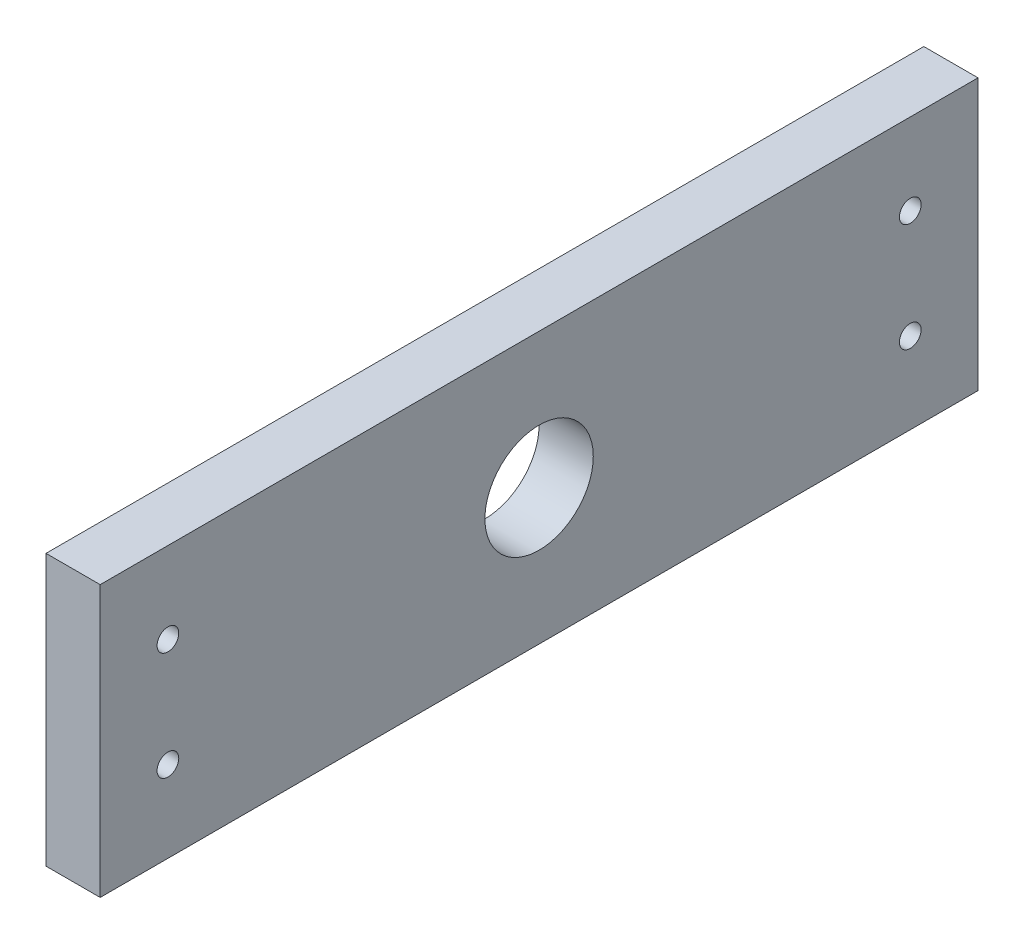
ISO-10303-21;
HEADER;
FILE_DESCRIPTION(('STEP AP214'),'2;1');
FILE_NAME('part.step','',(''),(''),'','','');
FILE_SCHEMA(('AUTOMOTIVE_DESIGN { 1 0 10303 214 1 1 1 1 }'));
ENDSEC;
DATA;
#1=APPLICATION_CONTEXT('core data for automotive mechanical design processes');
#2=APPLICATION_PROTOCOL_DEFINITION('international standard','automotive_design',2000,#1);
#3=PRODUCT_CONTEXT('',#1,'mechanical');
#4=PRODUCT('Part','Part','',(#3));
#5=PRODUCT_RELATED_PRODUCT_CATEGORY('part','',(#4));
#6=PRODUCT_DEFINITION_FORMATION('','',#4);
#7=PRODUCT_DEFINITION_CONTEXT('part definition',#1,'design');
#8=PRODUCT_DEFINITION('design','',#6,#7);
#9=PRODUCT_DEFINITION_SHAPE('','',#8);
#10=(LENGTH_UNIT() NAMED_UNIT(*) SI_UNIT(.MILLI.,.METRE.));
#11=(NAMED_UNIT(*) PLANE_ANGLE_UNIT() SI_UNIT($,.RADIAN.));
#12=(NAMED_UNIT(*) SI_UNIT($,.STERADIAN.) SOLID_ANGLE_UNIT());
#13=UNCERTAINTY_MEASURE_WITH_UNIT(LENGTH_MEASURE(1.E-05),#10,'distance_accuracy_value','');
#14=(GEOMETRIC_REPRESENTATION_CONTEXT(3) GLOBAL_UNCERTAINTY_ASSIGNED_CONTEXT((#13)) GLOBAL_UNIT_ASSIGNED_CONTEXT((#10,
#11,#12)) REPRESENTATION_CONTEXT('',''));
#15=CARTESIAN_POINT('',(0.,0.,0.));
#16=DIRECTION('',(0.,0.,1.));
#17=DIRECTION('',(1.,0.,0.));
#18=AXIS2_PLACEMENT_3D('',#15,#16,#17);
#19=CARTESIAN_POINT('',(10.,-25.,0.));
#20=DIRECTION('',(0.,1.,0.));
#21=DIRECTION('',(0.,0.,1.));
#22=AXIS2_PLACEMENT_3D('',#19,#20,#21);
#23=PLANE('',#22);
#24=DIRECTION('',(0.,0.,-1.));
#25=VECTOR('',#24,1.);
#26=CARTESIAN_POINT('',(0.,-25.,0.));
#27=LINE('',#26,#25);
#28=CARTESIAN_POINT('',(0.,-25.,81.));
#29=VERTEX_POINT('',#28);
#30=CARTESIAN_POINT('',(0.,-25.,-81.));
#31=VERTEX_POINT('',#30);
#32=EDGE_CURVE('E130',#29,#31,#27,.T.);
#33=ORIENTED_EDGE('',*,*,#32,.T.);
#34=DIRECTION('',(-1.,0.,0.));
#35=VECTOR('',#34,1.);
#36=CARTESIAN_POINT('',(10.,-25.,-81.));
#37=LINE('',#36,#35);
#38=CARTESIAN_POINT('',(10.,-25.,-81.));
#39=VERTEX_POINT('',#38);
#40=EDGE_CURVE('E11',#39,#31,#37,.T.);
#41=ORIENTED_EDGE('',*,*,#40,.F.);
#42=DIRECTION('',(0.,0.,-1.));
#43=VECTOR('',#42,1.);
#44=CARTESIAN_POINT('',(10.,-25.,0.));
#45=LINE('',#44,#43);
#46=CARTESIAN_POINT('',(10.,-25.,81.));
#47=VERTEX_POINT('',#46);
#48=EDGE_CURVE('E92',#47,#39,#45,.T.);
#49=ORIENTED_EDGE('',*,*,#48,.F.);
#50=DIRECTION('',(-1.,0.,0.));
#51=VECTOR('',#50,1.);
#52=CARTESIAN_POINT('',(10.,-25.,81.));
#53=LINE('',#52,#51);
#54=EDGE_CURVE('E58',#47,#29,#53,.T.);
#55=ORIENTED_EDGE('',*,*,#54,.T.);
#56=EDGE_LOOP('',(#33,#41,#49,#55));
#57=FACE_BOUND('',#56,.T.);
#58=ADVANCED_FACE('F41',(#57),#23,.F.);
#59=CARTESIAN_POINT('',(10.,0.,-81.));
#60=DIRECTION('',(0.,0.,1.));
#61=DIRECTION('',(1.,0.,0.));
#62=AXIS2_PLACEMENT_3D('',#59,#60,#61);
#63=PLANE('',#62);
#64=DIRECTION('',(0.,1.,0.));
#65=VECTOR('',#64,1.);
#66=CARTESIAN_POINT('',(0.,0.,-81.));
#67=LINE('',#66,#65);
#68=CARTESIAN_POINT('',(0.,25.,-81.));
#69=VERTEX_POINT('',#68);
#70=EDGE_CURVE('E98',#31,#69,#67,.T.);
#71=ORIENTED_EDGE('',*,*,#70,.T.);
#72=DIRECTION('',(-1.,0.,0.));
#73=VECTOR('',#72,1.);
#74=CARTESIAN_POINT('',(10.,25.,-81.));
#75=LINE('',#74,#73);
#76=CARTESIAN_POINT('',(10.,25.,-81.));
#77=VERTEX_POINT('',#76);
#78=EDGE_CURVE('E50',#77,#69,#75,.T.);
#79=ORIENTED_EDGE('',*,*,#78,.F.);
#80=DIRECTION('',(0.,1.,0.));
#81=VECTOR('',#80,1.);
#82=CARTESIAN_POINT('',(10.,0.,-81.));
#83=LINE('',#82,#81);
#84=EDGE_CURVE('E83',#39,#77,#83,.T.);
#85=ORIENTED_EDGE('',*,*,#84,.F.);
#86=ORIENTED_EDGE('',*,*,#40,.T.);
#87=EDGE_LOOP('',(#71,#79,#85,#86));
#88=FACE_BOUND('',#87,.T.);
#89=ADVANCED_FACE('F97',(#88),#63,.F.);
#90=CARTESIAN_POINT('',(10.,25.,0.));
#91=DIRECTION('',(0.,1.,0.));
#92=DIRECTION('',(0.,0.,1.));
#93=AXIS2_PLACEMENT_3D('',#90,#91,#92);
#94=PLANE('',#93);
#95=DIRECTION('',(0.,0.,-1.));
#96=VECTOR('',#95,1.);
#97=CARTESIAN_POINT('',(0.,25.,0.));
#98=LINE('',#97,#96);
#99=CARTESIAN_POINT('',(0.,25.,81.));
#100=VERTEX_POINT('',#99);
#101=EDGE_CURVE('E135',#100,#69,#98,.T.);
#102=ORIENTED_EDGE('',*,*,#101,.F.);
#103=DIRECTION('',(-1.,0.,0.));
#104=VECTOR('',#103,1.);
#105=CARTESIAN_POINT('',(10.,25.,81.));
#106=LINE('',#105,#104);
#107=CARTESIAN_POINT('',(10.,25.,81.));
#108=VERTEX_POINT('',#107);
#109=EDGE_CURVE('E72',#108,#100,#106,.T.);
#110=ORIENTED_EDGE('',*,*,#109,.F.);
#111=DIRECTION('',(0.,0.,-1.));
#112=VECTOR('',#111,1.);
#113=CARTESIAN_POINT('',(10.,25.,0.));
#114=LINE('',#113,#112);
#115=EDGE_CURVE('E91',#108,#77,#114,.T.);
#116=ORIENTED_EDGE('',*,*,#115,.T.);
#117=ORIENTED_EDGE('',*,*,#78,.T.);
#118=EDGE_LOOP('',(#102,#110,#116,#117));
#119=FACE_BOUND('',#118,.T.);
#120=ADVANCED_FACE('F102',(#119),#94,.T.);
#121=CARTESIAN_POINT('',(10.,-10.,68.5));
#122=DIRECTION('',(-1.,0.,0.));
#123=DIRECTION('',(0.,0.,1.));
#124=AXIS2_PLACEMENT_3D('',#121,#122,#123);
#125=CYLINDRICAL_SURFACE('',#124,2.);
#126=CARTESIAN_POINT('',(10.,-10.,68.5));
#127=DIRECTION('',(1.,0.,0.));
#128=DIRECTION('',(0.,0.,-1.));
#129=AXIS2_PLACEMENT_3D('',#126,#127,#128);
#130=CIRCLE('',#129,2.);
#131=CARTESIAN_POINT('',(10.,-10.,66.5));
#132=VERTEX_POINT('',#131);
#133=EDGE_CURVE('E122',#132,#132,#130,.T.);
#134=ORIENTED_EDGE('',*,*,#133,.T.);
#135=EDGE_LOOP('',(#134));
#136=FACE_BOUND('',#135,.T.);
#137=CARTESIAN_POINT('',(0.,-10.,68.5));
#138=DIRECTION('',(1.,0.,0.));
#139=DIRECTION('',(0.,0.,-1.));
#140=AXIS2_PLACEMENT_3D('',#137,#138,#139);
#141=CIRCLE('',#140,2.);
#142=CARTESIAN_POINT('',(0.,-10.,66.5));
#143=VERTEX_POINT('',#142);
#144=EDGE_CURVE('E154',#143,#143,#141,.T.);
#145=ORIENTED_EDGE('',*,*,#144,.F.);
#146=EDGE_LOOP('',(#145));
#147=FACE_BOUND('',#146,.T.);
#148=ADVANCED_FACE('F199',(#136,#147),#125,.F.);
#149=CARTESIAN_POINT('',(10.,0.,0.));
#150=DIRECTION('',(-1.,0.,0.));
#151=DIRECTION('',(0.,0.,1.));
#152=AXIS2_PLACEMENT_3D('',#149,#150,#151);
#153=CYLINDRICAL_SURFACE('',#152,10.);
#154=CARTESIAN_POINT('',(10.,0.,0.));
#155=DIRECTION('',(1.,0.,0.));
#156=DIRECTION('',(0.,0.,-1.));
#157=AXIS2_PLACEMENT_3D('',#154,#155,#156);
#158=CIRCLE('',#157,10.);
#159=CARTESIAN_POINT('',(10.,0.,-9.99999999999998));
#160=VERTEX_POINT('',#159);
#161=EDGE_CURVE('E118',#160,#160,#158,.T.);
#162=ORIENTED_EDGE('',*,*,#161,.T.);
#163=EDGE_LOOP('',(#162));
#164=FACE_BOUND('',#163,.T.);
#165=CARTESIAN_POINT('',(0.,0.,0.));
#166=DIRECTION('',(1.,0.,0.));
#167=DIRECTION('',(0.,0.,-1.));
#168=AXIS2_PLACEMENT_3D('',#165,#166,#167);
#169=CIRCLE('',#168,10.);
#170=CARTESIAN_POINT('',(0.,0.,-9.99999999999998));
#171=VERTEX_POINT('',#170);
#172=EDGE_CURVE('E150',#171,#171,#169,.T.);
#173=ORIENTED_EDGE('',*,*,#172,.F.);
#174=EDGE_LOOP('',(#173));
#175=FACE_BOUND('',#174,.T.);
#176=ADVANCED_FACE('F203',(#164,#175),#153,.F.);
#177=CARTESIAN_POINT('',(10.,-9.99999999999998,-68.5));
#178=DIRECTION('',(-1.,0.,0.));
#179=DIRECTION('',(0.,0.,1.));
#180=AXIS2_PLACEMENT_3D('',#177,#178,#179);
#181=CYLINDRICAL_SURFACE('',#180,2.);
#182=CARTESIAN_POINT('',(10.,-9.99999999999998,-68.5));
#183=DIRECTION('',(1.,0.,0.));
#184=DIRECTION('',(0.,0.,-1.));
#185=AXIS2_PLACEMENT_3D('',#182,#183,#184);
#186=CIRCLE('',#185,2.);
#187=CARTESIAN_POINT('',(10.,-9.99999999999998,-70.5));
#188=VERTEX_POINT('',#187);
#189=EDGE_CURVE('E114',#188,#188,#186,.F.);
#190=ORIENTED_EDGE('',*,*,#189,.F.);
#191=EDGE_LOOP('',(#190));
#192=FACE_BOUND('',#191,.T.);
#193=CARTESIAN_POINT('',(0.,-9.99999999999998,-68.5));
#194=DIRECTION('',(1.,0.,0.));
#195=DIRECTION('',(0.,0.,-1.));
#196=AXIS2_PLACEMENT_3D('',#193,#194,#195);
#197=CIRCLE('',#196,2.);
#198=CARTESIAN_POINT('',(0.,-9.99999999999998,-70.5));
#199=VERTEX_POINT('',#198);
#200=EDGE_CURVE('E146',#199,#199,#197,.F.);
#201=ORIENTED_EDGE('',*,*,#200,.T.);
#202=EDGE_LOOP('',(#201));
#203=FACE_BOUND('',#202,.T.);
#204=ADVANCED_FACE('F193',(#192,#203),#181,.F.);
#205=CARTESIAN_POINT('',(10.,9.99999999999999,-68.5));
#206=DIRECTION('',(-1.,0.,0.));
#207=DIRECTION('',(0.,0.,1.));
#208=AXIS2_PLACEMENT_3D('',#205,#206,#207);
#209=CYLINDRICAL_SURFACE('',#208,2.);
#210=CARTESIAN_POINT('',(10.,9.99999999999999,-68.5));
#211=DIRECTION('',(1.,0.,0.));
#212=DIRECTION('',(0.,0.,-1.));
#213=AXIS2_PLACEMENT_3D('',#210,#211,#212);
#214=CIRCLE('',#213,2.);
#215=CARTESIAN_POINT('',(10.,9.99999999999999,-70.5));
#216=VERTEX_POINT('',#215);
#217=EDGE_CURVE('E107',#216,#216,#214,.T.);
#218=ORIENTED_EDGE('',*,*,#217,.T.);
#219=EDGE_LOOP('',(#218));
#220=FACE_BOUND('',#219,.T.);
#221=CARTESIAN_POINT('',(0.,9.99999999999999,-68.5));
#222=DIRECTION('',(1.,0.,0.));
#223=DIRECTION('',(0.,0.,-1.));
#224=AXIS2_PLACEMENT_3D('',#221,#222,#223);
#225=CIRCLE('',#224,2.);
#226=CARTESIAN_POINT('',(0.,9.99999999999999,-70.5));
#227=VERTEX_POINT('',#226);
#228=EDGE_CURVE('E142',#227,#227,#225,.T.);
#229=ORIENTED_EDGE('',*,*,#228,.F.);
#230=EDGE_LOOP('',(#229));
#231=FACE_BOUND('',#230,.T.);
#232=ADVANCED_FACE('F186',(#220,#231),#209,.F.);
#233=CARTESIAN_POINT('',(10.,0.,81.));
#234=DIRECTION('',(0.,0.,1.));
#235=DIRECTION('',(1.,0.,0.));
#236=AXIS2_PLACEMENT_3D('',#233,#234,#235);
#237=PLANE('',#236);
#238=DIRECTION('',(0.,1.,0.));
#239=VECTOR('',#238,1.);
#240=CARTESIAN_POINT('',(0.,0.,81.));
#241=LINE('',#240,#239);
#242=EDGE_CURVE('E138',#29,#100,#241,.T.);
#243=ORIENTED_EDGE('',*,*,#242,.F.);
#244=ORIENTED_EDGE('',*,*,#54,.F.);
#245=DIRECTION('',(0.,1.,0.));
#246=VECTOR('',#245,1.);
#247=CARTESIAN_POINT('',(10.,0.,81.));
#248=LINE('',#247,#246);
#249=EDGE_CURVE('E104',#47,#108,#248,.T.);
#250=ORIENTED_EDGE('',*,*,#249,.T.);
#251=ORIENTED_EDGE('',*,*,#109,.T.);
#252=EDGE_LOOP('',(#243,#244,#250,#251));
#253=FACE_BOUND('',#252,.T.);
#254=ADVANCED_FACE('F184',(#253),#237,.T.);
#255=CARTESIAN_POINT('',(10.,9.99999999999997,68.5));
#256=DIRECTION('',(-1.,0.,0.));
#257=DIRECTION('',(0.,0.,1.));
#258=AXIS2_PLACEMENT_3D('',#255,#256,#257);
#259=CYLINDRICAL_SURFACE('',#258,2.00000000000001);
#260=CARTESIAN_POINT('',(10.,9.99999999999997,68.5));
#261=DIRECTION('',(1.,0.,0.));
#262=DIRECTION('',(0.,0.,-1.));
#263=AXIS2_PLACEMENT_3D('',#260,#261,#262);
#264=CIRCLE('',#263,2.00000000000001);
#265=CARTESIAN_POINT('',(10.,9.99999999999997,66.5));
#266=VERTEX_POINT('',#265);
#267=EDGE_CURVE('E126',#266,#266,#264,.F.);
#268=ORIENTED_EDGE('',*,*,#267,.F.);
#269=EDGE_LOOP('',(#268));
#270=FACE_BOUND('',#269,.T.);
#271=CARTESIAN_POINT('',(0.,9.99999999999997,68.5));
#272=DIRECTION('',(1.,0.,0.));
#273=DIRECTION('',(0.,0.,-1.));
#274=AXIS2_PLACEMENT_3D('',#271,#272,#273);
#275=CIRCLE('',#274,2.00000000000001);
#276=CARTESIAN_POINT('',(0.,9.99999999999997,66.5));
#277=VERTEX_POINT('',#276);
#278=EDGE_CURVE('E158',#277,#277,#275,.F.);
#279=ORIENTED_EDGE('',*,*,#278,.T.);
#280=EDGE_LOOP('',(#279));
#281=FACE_BOUND('',#280,.T.);
#282=ADVANCED_FACE('F168',(#270,#281),#259,.F.);
#283=CARTESIAN_POINT('',(10.,0.,0.));
#284=DIRECTION('',(1.,0.,0.));
#285=DIRECTION('',(0.,0.,-1.));
#286=AXIS2_PLACEMENT_3D('',#283,#284,#285);
#287=PLANE('',#286);
#288=ORIENTED_EDGE('',*,*,#48,.T.);
#289=ORIENTED_EDGE('',*,*,#84,.T.);
#290=ORIENTED_EDGE('',*,*,#115,.F.);
#291=ORIENTED_EDGE('',*,*,#249,.F.);
#292=EDGE_LOOP('',(#288,#289,#290,#291));
#293=FACE_BOUND('',#292,.T.);
#294=ORIENTED_EDGE('',*,*,#217,.F.);
#295=EDGE_LOOP('',(#294));
#296=FACE_BOUND('',#295,.T.);
#297=ORIENTED_EDGE('',*,*,#189,.T.);
#298=EDGE_LOOP('',(#297));
#299=FACE_BOUND('',#298,.T.);
#300=ORIENTED_EDGE('',*,*,#161,.F.);
#301=EDGE_LOOP('',(#300));
#302=FACE_BOUND('',#301,.T.);
#303=ORIENTED_EDGE('',*,*,#133,.F.);
#304=EDGE_LOOP('',(#303));
#305=FACE_BOUND('',#304,.T.);
#306=ORIENTED_EDGE('',*,*,#267,.T.);
#307=EDGE_LOOP('',(#306));
#308=FACE_BOUND('',#307,.T.);
#309=ADVANCED_FACE('F87',(#293,#296,#299,#302,#305,#308),#287,.T.);
#310=CARTESIAN_POINT('',(0.,0.,0.));
#311=DIRECTION('',(1.,0.,0.));
#312=DIRECTION('',(0.,0.,-1.));
#313=AXIS2_PLACEMENT_3D('',#310,#311,#312);
#314=PLANE('',#313);
#315=ORIENTED_EDGE('',*,*,#32,.F.);
#316=ORIENTED_EDGE('',*,*,#242,.T.);
#317=ORIENTED_EDGE('',*,*,#101,.T.);
#318=ORIENTED_EDGE('',*,*,#70,.F.);
#319=EDGE_LOOP('',(#315,#316,#317,#318));
#320=FACE_BOUND('',#319,.T.);
#321=ORIENTED_EDGE('',*,*,#228,.T.);
#322=EDGE_LOOP('',(#321));
#323=FACE_BOUND('',#322,.T.);
#324=ORIENTED_EDGE('',*,*,#200,.F.);
#325=EDGE_LOOP('',(#324));
#326=FACE_BOUND('',#325,.T.);
#327=ORIENTED_EDGE('',*,*,#172,.T.);
#328=EDGE_LOOP('',(#327));
#329=FACE_BOUND('',#328,.T.);
#330=ORIENTED_EDGE('',*,*,#144,.T.);
#331=EDGE_LOOP('',(#330));
#332=FACE_BOUND('',#331,.T.);
#333=ORIENTED_EDGE('',*,*,#278,.F.);
#334=EDGE_LOOP('',(#333));
#335=FACE_BOUND('',#334,.T.);
#336=ADVANCED_FACE('F170',(#320,#323,#326,#329,#332,#335),#314,.F.);
#337=CLOSED_SHELL('',(#58,#89,#120,#148,#176,#204,#232,#254,#282,#309,#336));
#338=MANIFOLD_SOLID_BREP('B2',#337);
#339=ADVANCED_BREP_SHAPE_REPRESENTATION('',(#18,#338),#14);
#340=SHAPE_DEFINITION_REPRESENTATION(#9,#339);
ENDSEC;
END-ISO-10303-21;
